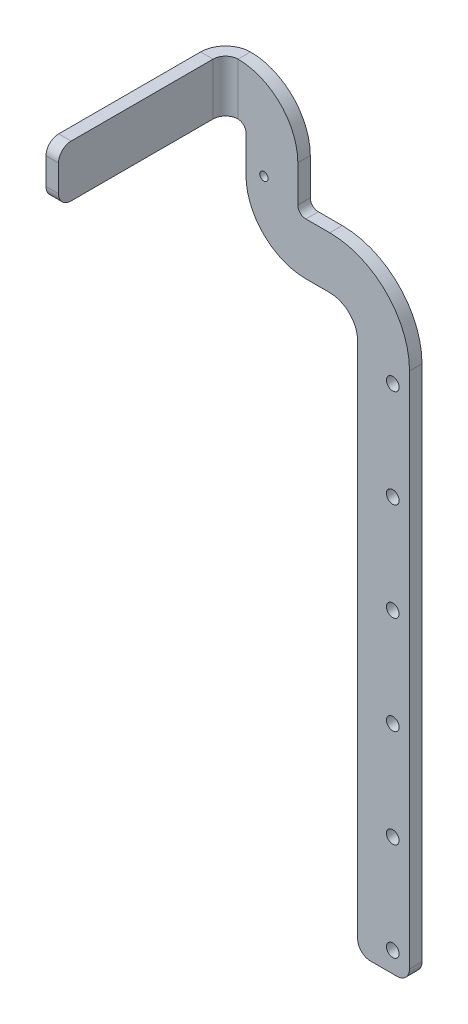
ISO-10303-21;
HEADER;
FILE_DESCRIPTION(('STEP AP214'),'2;1');
FILE_NAME('part.step','',(''),(''),'','','');
FILE_SCHEMA(('AUTOMOTIVE_DESIGN { 1 0 10303 214 1 1 1 1 }'));
ENDSEC;
DATA;
#1=APPLICATION_CONTEXT('core data for automotive mechanical design processes');
#2=APPLICATION_PROTOCOL_DEFINITION('international standard','automotive_design',2000,#1);
#3=PRODUCT_CONTEXT('',#1,'mechanical');
#4=PRODUCT('Part','Part','',(#3));
#5=PRODUCT_RELATED_PRODUCT_CATEGORY('part','',(#4));
#6=PRODUCT_DEFINITION_FORMATION('','',#4);
#7=PRODUCT_DEFINITION_CONTEXT('part definition',#1,'design');
#8=PRODUCT_DEFINITION('design','',#6,#7);
#9=PRODUCT_DEFINITION_SHAPE('','',#8);
#10=(LENGTH_UNIT() NAMED_UNIT(*) SI_UNIT(.MILLI.,.METRE.));
#11=(NAMED_UNIT(*) PLANE_ANGLE_UNIT() SI_UNIT($,.RADIAN.));
#12=(NAMED_UNIT(*) SI_UNIT($,.STERADIAN.) SOLID_ANGLE_UNIT());
#13=UNCERTAINTY_MEASURE_WITH_UNIT(LENGTH_MEASURE(1.E-05),#10,'distance_accuracy_value','');
#14=(GEOMETRIC_REPRESENTATION_CONTEXT(3) GLOBAL_UNCERTAINTY_ASSIGNED_CONTEXT((#13)) GLOBAL_UNIT_ASSIGNED_CONTEXT((#10,
#11,#12)) REPRESENTATION_CONTEXT('',''));
#15=CARTESIAN_POINT('',(0.,0.,0.));
#16=DIRECTION('',(0.,0.,1.));
#17=DIRECTION('',(1.,0.,0.));
#18=AXIS2_PLACEMENT_3D('',#15,#16,#17);
#19=CARTESIAN_POINT('',(123482.998157255,24999.885796135,0.));
#20=DIRECTION('',(0.,-1.,0.));
#21=DIRECTION('',(1.,0.,0.));
#22=AXIS2_PLACEMENT_3D('',#19,#20,#21);
#23=PLANE('',#22);
#24=DIRECTION('',(1.,0.,0.));
#25=VECTOR('',#24,1.);
#26=CARTESIAN_POINT('',(123475.998157255,24999.885796135,3.125));
#27=LINE('',#26,#25);
#28=CARTESIAN_POINT('',(123486.173157255,24999.885796135,3.125));
#29=VERTEX_POINT('',#28);
#30=CARTESIAN_POINT('',(123492.823157255,24999.885796135,3.125));
#31=VERTEX_POINT('',#30);
#32=EDGE_CURVE('E353',#29,#31,#27,.T.);
#33=ORIENTED_EDGE('',*,*,#32,.F.);
#34=DIRECTION('',(0.,0.,1.));
#35=VECTOR('',#34,1.);
#36=CARTESIAN_POINT('',(123486.173157255,24999.885796135,0.));
#37=LINE('',#36,#35);
#38=CARTESIAN_POINT('',(123486.173157255,24999.885796135,0.));
#39=VERTEX_POINT('',#38);
#40=EDGE_CURVE('E405',#29,#39,#37,.F.);
#41=ORIENTED_EDGE('',*,*,#40,.T.);
#42=DIRECTION('',(1.,0.,0.));
#43=VECTOR('',#42,1.);
#44=CARTESIAN_POINT('',(123482.998157255,24999.885796135,0.));
#45=LINE('',#44,#43);
#46=CARTESIAN_POINT('',(123492.823157255,24999.885796135,0.));
#47=VERTEX_POINT('',#46);
#48=EDGE_CURVE('E282',#39,#47,#45,.T.);
#49=ORIENTED_EDGE('',*,*,#48,.T.);
#50=DIRECTION('',(0.,0.,-1.));
#51=VECTOR('',#50,1.);
#52=CARTESIAN_POINT('',(123492.823157255,24999.885796135,0.));
#53=LINE('',#52,#51);
#54=EDGE_CURVE('E384',#31,#47,#53,.T.);
#55=ORIENTED_EDGE('',*,*,#54,.F.);
#56=EDGE_LOOP('',(#33,#41,#49,#55));
#57=FACE_BOUND('',#56,.T.);
#58=ADVANCED_FACE('F66',(#57),#23,.T.);
#59=CARTESIAN_POINT('',(123482.998157255,24999.885796135,0.));
#60=DIRECTION('',(1.,0.,0.));
#61=DIRECTION('',(0.,1.,0.));
#62=AXIS2_PLACEMENT_3D('',#59,#60,#61);
#63=PLANE('',#62);
#64=DIRECTION('',(0.,1.,0.));
#65=VECTOR('',#64,1.);
#66=CARTESIAN_POINT('',(123482.998157255,24999.885796135,0.));
#67=LINE('',#66,#65);
#68=CARTESIAN_POINT('',(123482.998157255,25003.060796135,0.));
#69=VERTEX_POINT('',#68);
#70=CARTESIAN_POINT('',(123482.998157255,25132.885796135,0.));
#71=VERTEX_POINT('',#70);
#72=EDGE_CURVE('E284',#69,#71,#67,.T.);
#73=ORIENTED_EDGE('',*,*,#72,.F.);
#74=DIRECTION('',(0.,0.,-1.));
#75=VECTOR('',#74,1.);
#76=CARTESIAN_POINT('',(123482.998157255,25003.060796135,0.));
#77=LINE('',#76,#75);
#78=CARTESIAN_POINT('',(123482.998157255,25003.060796135,3.125));
#79=VERTEX_POINT('',#78);
#80=EDGE_CURVE('E75',#69,#79,#77,.F.);
#81=ORIENTED_EDGE('',*,*,#80,.T.);
#82=DIRECTION('',(0.,1.,0.));
#83=VECTOR('',#82,1.);
#84=CARTESIAN_POINT('',(123482.998157255,25132.885796135,3.125));
#85=LINE('',#84,#83);
#86=CARTESIAN_POINT('',(123482.998157255,25132.885796135,3.125));
#87=VERTEX_POINT('',#86);
#88=EDGE_CURVE('E351',#79,#87,#85,.T.);
#89=ORIENTED_EDGE('',*,*,#88,.T.);
#90=DIRECTION('',(0.,0.,-1.));
#91=VECTOR('',#90,1.);
#92=CARTESIAN_POINT('',(123482.998157255,25132.885796135,0.));
#93=LINE('',#92,#91);
#94=EDGE_CURVE('E381',#87,#71,#93,.T.);
#95=ORIENTED_EDGE('',*,*,#94,.T.);
#96=EDGE_LOOP('',(#73,#81,#89,#95));
#97=FACE_BOUND('',#96,.T.);
#98=ADVANCED_FACE('F480',(#97),#63,.F.);
#99=CARTESIAN_POINT('',(123475.998157249,25132.885796135,0.));
#100=DIRECTION('',(0.,0.,1.));
#101=DIRECTION('',(1.,0.,0.));
#102=AXIS2_PLACEMENT_3D('',#99,#100,#101);
#103=CYLINDRICAL_SURFACE('',#102,7.00000000554723);
#104=ORIENTED_EDGE('',*,*,#94,.F.);
#105=CARTESIAN_POINT('',(123475.998157249,25132.885796135,3.125));
#106=DIRECTION('',(0.,0.,1.));
#107=DIRECTION('',(1.,0.,0.));
#108=AXIS2_PLACEMENT_3D('',#105,#106,#107);
#109=CIRCLE('',#108,7.00000000554723);
#110=CARTESIAN_POINT('',(123475.998158089,25139.8857961352,3.125));
#111=VERTEX_POINT('',#110);
#112=EDGE_CURVE('E348',#87,#111,#109,.T.);
#113=ORIENTED_EDGE('',*,*,#112,.T.);
#114=DIRECTION('',(0.,0.,-1.));
#115=VECTOR('',#114,1.);
#116=CARTESIAN_POINT('',(123475.998158089,25139.8857961352,0.));
#117=LINE('',#116,#115);
#118=CARTESIAN_POINT('',(123475.998158089,25139.8857961352,0.));
#119=VERTEX_POINT('',#118);
#120=EDGE_CURVE('E379',#111,#119,#117,.T.);
#121=ORIENTED_EDGE('',*,*,#120,.T.);
#122=CARTESIAN_POINT('',(123475.998157249,25132.885796135,0.));
#123=DIRECTION('',(0.,0.,1.));
#124=DIRECTION('',(1.,0.,0.));
#125=AXIS2_PLACEMENT_3D('',#122,#123,#124);
#126=CIRCLE('',#125,7.00000000554723);
#127=EDGE_CURVE('E286',#71,#119,#126,.T.);
#128=ORIENTED_EDGE('',*,*,#127,.F.);
#129=EDGE_LOOP('',(#104,#113,#121,#128));
#130=FACE_BOUND('',#129,.T.);
#131=ADVANCED_FACE('F485',(#130),#103,.F.);
#132=CARTESIAN_POINT('',(123469.998184079,25139.8857968504,0.));
#133=DIRECTION('',(-1.19194060241819E-07,-0.999999999999993,0.));
#134=DIRECTION('',(0.999999999999993,-1.19194060241819E-07,0.));
#135=AXIS2_PLACEMENT_3D('',#132,#133,#134);
#136=PLANE('',#135);
#137=ORIENTED_EDGE('',*,*,#120,.F.);
#138=DIRECTION('',(0.999999999999993,-1.19194060241819E-07,0.));
#139=VECTOR('',#138,1.);
#140=CARTESIAN_POINT('',(123469.998184079,25139.8857968504,3.125));
#141=LINE('',#140,#139);
#142=CARTESIAN_POINT('',(123469.998184079,25139.8857968503,3.125));
#143=VERTEX_POINT('',#142);
#144=EDGE_CURVE('E345',#143,#111,#141,.T.);
#145=ORIENTED_EDGE('',*,*,#144,.F.);
#146=DIRECTION('',(0.,0.,-1.));
#147=VECTOR('',#146,1.);
#148=CARTESIAN_POINT('',(123469.998184079,25139.8857968503,0.));
#149=LINE('',#148,#147);
#150=CARTESIAN_POINT('',(123469.998184079,25139.8857968503,0.));
#151=VERTEX_POINT('',#150);
#152=EDGE_CURVE('E377',#143,#151,#149,.T.);
#153=ORIENTED_EDGE('',*,*,#152,.T.);
#154=DIRECTION('',(0.999999999999993,-1.19194060241819E-07,0.));
#155=VECTOR('',#154,1.);
#156=CARTESIAN_POINT('',(123469.998184079,25139.8857968504,0.));
#157=LINE('',#156,#155);
#158=EDGE_CURVE('E289',#151,#119,#157,.T.);
#159=ORIENTED_EDGE('',*,*,#158,.T.);
#160=EDGE_LOOP('',(#137,#145,#153,#159));
#161=FACE_BOUND('',#160,.T.);
#162=ADVANCED_FACE('F510',(#161),#136,.T.);
#163=CARTESIAN_POINT('',(123469.998185867,25154.8857968489,0.));
#164=DIRECTION('',(0.,0.,1.));
#165=DIRECTION('',(1.,0.,0.));
#166=AXIS2_PLACEMENT_3D('',#163,#164,#165);
#167=CYLINDRICAL_SURFACE('',#166,14.9999999986276);
#168=ORIENTED_EDGE('',*,*,#152,.F.);
#169=CARTESIAN_POINT('',(123469.998185867,25154.8857968489,3.125));
#170=DIRECTION('',(0.,0.,1.));
#171=DIRECTION('',(1.,0.,0.));
#172=AXIS2_PLACEMENT_3D('',#169,#170,#171);
#173=CIRCLE('',#172,14.9999999986276);
#174=CARTESIAN_POINT('',(123454.998185868,25154.8857986359,3.125));
#175=VERTEX_POINT('',#174);
#176=EDGE_CURVE('E342',#175,#143,#173,.T.);
#177=ORIENTED_EDGE('',*,*,#176,.F.);
#178=DIRECTION('',(0.,0.,-1.));
#179=VECTOR('',#178,1.);
#180=CARTESIAN_POINT('',(123454.998185868,25154.8857986359,0.));
#181=LINE('',#180,#179);
#182=CARTESIAN_POINT('',(123454.998185868,25154.8857986359,0.));
#183=VERTEX_POINT('',#182);
#184=EDGE_CURVE('E375',#175,#183,#181,.T.);
#185=ORIENTED_EDGE('',*,*,#184,.T.);
#186=CARTESIAN_POINT('',(123469.998185867,25154.8857968489,0.));
#187=DIRECTION('',(0.,0.,1.));
#188=DIRECTION('',(1.,0.,0.));
#189=AXIS2_PLACEMENT_3D('',#186,#187,#188);
#190=CIRCLE('',#189,14.9999999986276);
#191=EDGE_CURVE('E292',#183,#151,#190,.T.);
#192=ORIENTED_EDGE('',*,*,#191,.T.);
#193=EDGE_LOOP('',(#168,#177,#185,#192));
#194=FACE_BOUND('',#193,.T.);
#195=ADVANCED_FACE('F514',(#194),#167,.T.);
#196=CARTESIAN_POINT('',(123454.998186963,25164.0775368475,0.));
#197=DIRECTION('',(-0.999999999999993,1.19068771400868E-07,0.));
#198=DIRECTION('',(-1.19068771400868E-07,-0.999999999999993,0.));
#199=AXIS2_PLACEMENT_3D('',#196,#197,#198);
#200=PLANE('',#199);
#201=ORIENTED_EDGE('',*,*,#184,.F.);
#202=DIRECTION('',(-1.19068771400868E-07,-0.999999999999993,0.));
#203=VECTOR('',#202,1.);
#204=CARTESIAN_POINT('',(123454.998186963,25164.0775368475,3.125));
#205=LINE('',#204,#203);
#206=CARTESIAN_POINT('',(123454.998186963,25164.0775368475,3.125));
#207=VERTEX_POINT('',#206);
#208=EDGE_CURVE('E339',#207,#175,#205,.T.);
#209=ORIENTED_EDGE('',*,*,#208,.F.);
#210=DIRECTION('',(0.,0.,-1.));
#211=VECTOR('',#210,1.);
#212=CARTESIAN_POINT('',(123454.998186963,25164.0775368475,0.));
#213=LINE('',#212,#211);
#214=CARTESIAN_POINT('',(123454.998186963,25164.0775368475,0.));
#215=VERTEX_POINT('',#214);
#216=EDGE_CURVE('E373',#207,#215,#213,.T.);
#217=ORIENTED_EDGE('',*,*,#216,.T.);
#218=DIRECTION('',(-1.19068771400868E-07,-0.999999999999993,0.));
#219=VECTOR('',#218,1.);
#220=CARTESIAN_POINT('',(123454.998186963,25164.0775368475,0.));
#221=LINE('',#220,#219);
#222=EDGE_CURVE('E295',#215,#183,#221,.T.);
#223=ORIENTED_EDGE('',*,*,#222,.T.);
#224=EDGE_LOOP('',(#201,#209,#217,#223));
#225=FACE_BOUND('',#224,.T.);
#226=ADVANCED_FACE('F518',(#225),#200,.T.);
#227=CARTESIAN_POINT('',(123452.998186964,25164.0775370857,0.));
#228=DIRECTION('',(0.,0.,1.));
#229=DIRECTION('',(1.,0.,0.));
#230=AXIS2_PLACEMENT_3D('',#227,#228,#229);
#231=CYLINDRICAL_SURFACE('',#230,1.99999999951592);
#232=ORIENTED_EDGE('',*,*,#216,.F.);
#233=CARTESIAN_POINT('',(123452.998186964,25164.0775370857,3.125));
#234=DIRECTION('',(0.,0.,1.));
#235=DIRECTION('',(1.,0.,0.));
#236=AXIS2_PLACEMENT_3D('',#233,#234,#235);
#237=CIRCLE('',#236,1.99999999951592);
#238=CARTESIAN_POINT('',(123452.998157255,25166.077537085,3.125));
#239=VERTEX_POINT('',#238);
#240=EDGE_CURVE('E336',#207,#239,#237,.T.);
#241=ORIENTED_EDGE('',*,*,#240,.T.);
#242=DIRECTION('',(0.,0.,-1.));
#243=VECTOR('',#242,1.);
#244=CARTESIAN_POINT('',(123452.998157255,25166.0775370852,0.));
#245=LINE('',#244,#243);
#246=CARTESIAN_POINT('',(123452.998157255,25166.077537085,-2.842344415388E-12));
#247=VERTEX_POINT('',#246);
#248=EDGE_CURVE('E370',#239,#247,#245,.T.);
#249=ORIENTED_EDGE('',*,*,#248,.T.);
#250=CARTESIAN_POINT('',(123452.998186964,25164.0775370857,0.));
#251=DIRECTION('',(0.,0.,1.));
#252=DIRECTION('',(1.,0.,0.));
#253=AXIS2_PLACEMENT_3D('',#250,#251,#252);
#254=CIRCLE('',#253,1.99999999951592);
#255=EDGE_CURVE('E298',#215,#247,#254,.T.);
#256=ORIENTED_EDGE('',*,*,#255,.F.);
#257=EDGE_LOOP('',(#232,#241,#249,#256));
#258=FACE_BOUND('',#257,.T.);
#259=ADVANCED_FACE('F522',(#258),#231,.F.);
#260=CARTESIAN_POINT('',(123452.998186964,25164.0775370857,0.));
#261=DIRECTION('',(0.,0.,1.));
#262=DIRECTION('',(1.,0.,0.));
#263=AXIS2_PLACEMENT_3D('',#260,#261,#262);
#264=CYLINDRICAL_SURFACE('',#263,14.9999999996743);
#265=DIRECTION('',(0.,0.,-1.));
#266=VECTOR('',#265,1.);
#267=CARTESIAN_POINT('',(123452.998157255,25179.0775370854,0.));
#268=LINE('',#267,#266);
#269=CARTESIAN_POINT('',(123452.998157255,25179.0775370854,3.125));
#270=VERTEX_POINT('',#269);
#271=CARTESIAN_POINT('',(123452.998157255,25179.0775370854,0.));
#272=VERTEX_POINT('',#271);
#273=EDGE_CURVE('E367',#270,#272,#268,.T.);
#274=ORIENTED_EDGE('',*,*,#273,.F.);
#275=CARTESIAN_POINT('',(123452.998186964,25164.0775370857,3.125));
#276=DIRECTION('',(0.,0.,1.));
#277=DIRECTION('',(1.,0.,0.));
#278=AXIS2_PLACEMENT_3D('',#275,#276,#277);
#279=CIRCLE('',#278,14.9999999996743);
#280=CARTESIAN_POINT('',(123467.998186963,25164.0775352988,3.125));
#281=VERTEX_POINT('',#280);
#282=EDGE_CURVE('E331',#281,#270,#279,.T.);
#283=ORIENTED_EDGE('',*,*,#282,.F.);
#284=DIRECTION('',(0.,0.,-1.));
#285=VECTOR('',#284,1.);
#286=CARTESIAN_POINT('',(123467.998186963,25164.0775352988,0.));
#287=LINE('',#286,#285);
#288=CARTESIAN_POINT('',(123467.998186963,25164.0775352988,0.));
#289=VERTEX_POINT('',#288);
#290=EDGE_CURVE('E365',#281,#289,#287,.T.);
#291=ORIENTED_EDGE('',*,*,#290,.T.);
#292=CARTESIAN_POINT('',(123452.998186964,25164.0775370857,0.));
#293=DIRECTION('',(0.,0.,1.));
#294=DIRECTION('',(1.,0.,0.));
#295=AXIS2_PLACEMENT_3D('',#292,#293,#294);
#296=CIRCLE('',#295,14.9999999996743);
#297=EDGE_CURVE('E301',#289,#272,#296,.T.);
#298=ORIENTED_EDGE('',*,*,#297,.T.);
#299=EDGE_LOOP('',(#274,#283,#291,#298));
#300=FACE_BOUND('',#299,.T.);
#301=ADVANCED_FACE('F443',(#300),#264,.T.);
#302=CARTESIAN_POINT('',(123467.998185868,25154.8857970872,0.));
#303=DIRECTION('',(0.999999999999993,-1.19161534191073E-07,0.));
#304=DIRECTION('',(1.19161534191073E-07,0.999999999999993,0.));
#305=AXIS2_PLACEMENT_3D('',#302,#303,#304);
#306=PLANE('',#305);
#307=ORIENTED_EDGE('',*,*,#290,.F.);
#308=DIRECTION('',(1.19161534191073E-07,0.999999999999993,0.));
#309=VECTOR('',#308,1.);
#310=CARTESIAN_POINT('',(123467.998185868,25154.8857970872,3.125));
#311=LINE('',#310,#309);
#312=CARTESIAN_POINT('',(123467.998185868,25154.8857970872,3.125));
#313=VERTEX_POINT('',#312);
#314=EDGE_CURVE('E328',#313,#281,#311,.T.);
#315=ORIENTED_EDGE('',*,*,#314,.F.);
#316=DIRECTION('',(0.,0.,-1.));
#317=VECTOR('',#316,1.);
#318=CARTESIAN_POINT('',(123467.998185868,25154.8857970872,0.));
#319=LINE('',#318,#317);
#320=CARTESIAN_POINT('',(123467.998185868,25154.8857970872,0.));
#321=VERTEX_POINT('',#320);
#322=EDGE_CURVE('E363',#313,#321,#319,.T.);
#323=ORIENTED_EDGE('',*,*,#322,.T.);
#324=DIRECTION('',(1.19161534191073E-07,0.999999999999993,0.));
#325=VECTOR('',#324,1.);
#326=CARTESIAN_POINT('',(123467.998185868,25154.8857970872,0.));
#327=LINE('',#326,#325);
#328=EDGE_CURVE('E304',#321,#289,#327,.T.);
#329=ORIENTED_EDGE('',*,*,#328,.T.);
#330=EDGE_LOOP('',(#307,#315,#323,#329));
#331=FACE_BOUND('',#330,.T.);
#332=ADVANCED_FACE('F439',(#331),#306,.T.);
#333=CARTESIAN_POINT('',(123469.998185867,25154.8857968489,0.));
#334=DIRECTION('',(0.,0.,1.));
#335=DIRECTION('',(1.,0.,0.));
#336=AXIS2_PLACEMENT_3D('',#333,#334,#335);
#337=CYLINDRICAL_SURFACE('',#336,1.99999999919777);
#338=ORIENTED_EDGE('',*,*,#322,.F.);
#339=CARTESIAN_POINT('',(123469.998185867,25154.8857968489,3.125));
#340=DIRECTION('',(0.,0.,1.));
#341=DIRECTION('',(1.,0.,0.));
#342=AXIS2_PLACEMENT_3D('',#339,#340,#341);
#343=CIRCLE('',#342,1.99999999919777);
#344=CARTESIAN_POINT('',(123469.998185629,25152.8857968499,3.125));
#345=VERTEX_POINT('',#344);
#346=EDGE_CURVE('E325',#313,#345,#343,.T.);
#347=ORIENTED_EDGE('',*,*,#346,.T.);
#348=DIRECTION('',(0.,0.,-1.));
#349=VECTOR('',#348,1.);
#350=CARTESIAN_POINT('',(123469.998185629,25152.8857968499,0.));
#351=LINE('',#350,#349);
#352=CARTESIAN_POINT('',(123469.998185629,25152.8857968499,0.));
#353=VERTEX_POINT('',#352);
#354=EDGE_CURVE('E361',#345,#353,#351,.T.);
#355=ORIENTED_EDGE('',*,*,#354,.T.);
#356=CARTESIAN_POINT('',(123469.998185867,25154.8857968489,0.));
#357=DIRECTION('',(0.,0.,1.));
#358=DIRECTION('',(1.,0.,0.));
#359=AXIS2_PLACEMENT_3D('',#356,#357,#358);
#360=CIRCLE('',#359,1.99999999919777);
#361=EDGE_CURVE('E307',#321,#353,#360,.T.);
#362=ORIENTED_EDGE('',*,*,#361,.F.);
#363=EDGE_LOOP('',(#338,#347,#355,#362));
#364=FACE_BOUND('',#363,.T.);
#365=ADVANCED_FACE('F435',(#364),#337,.F.);
#366=CARTESIAN_POINT('',(123475.998159637,25152.8857961356,0.));
#367=DIRECTION('',(1.19048398376522E-07,0.999999999999993,0.));
#368=DIRECTION('',(-0.999999999999993,1.19048398376522E-07,0.));
#369=AXIS2_PLACEMENT_3D('',#366,#367,#368);
#370=PLANE('',#369);
#371=ORIENTED_EDGE('',*,*,#354,.F.);
#372=DIRECTION('',(-0.999999999999993,1.19048398376522E-07,0.));
#373=VECTOR('',#372,1.);
#374=CARTESIAN_POINT('',(123475.998159637,25152.8857961356,3.125));
#375=LINE('',#374,#373);
#376=CARTESIAN_POINT('',(123475.998159637,25152.8857961355,3.125));
#377=VERTEX_POINT('',#376);
#378=EDGE_CURVE('E322',#377,#345,#375,.T.);
#379=ORIENTED_EDGE('',*,*,#378,.F.);
#380=DIRECTION('',(0.,0.,-1.));
#381=VECTOR('',#380,1.);
#382=CARTESIAN_POINT('',(123475.998159637,25152.8857961355,0.));
#383=LINE('',#382,#381);
#384=CARTESIAN_POINT('',(123475.998159637,25152.8857961355,0.));
#385=VERTEX_POINT('',#384);
#386=EDGE_CURVE('E359',#377,#385,#383,.T.);
#387=ORIENTED_EDGE('',*,*,#386,.T.);
#388=DIRECTION('',(-0.999999999999993,1.19048398376522E-07,0.));
#389=VECTOR('',#388,1.);
#390=CARTESIAN_POINT('',(123475.998159637,25152.8857961356,0.));
#391=LINE('',#390,#389);
#392=EDGE_CURVE('E310',#385,#353,#391,.T.);
#393=ORIENTED_EDGE('',*,*,#392,.T.);
#394=EDGE_LOOP('',(#371,#379,#387,#393));
#395=FACE_BOUND('',#394,.T.);
#396=ADVANCED_FACE('F573',(#395),#370,.T.);
#397=CARTESIAN_POINT('',(123475.998157255,25132.885796135,0.));
#398=DIRECTION('',(0.,0.,1.));
#399=DIRECTION('',(1.,0.,0.));
#400=AXIS2_PLACEMENT_3D('',#397,#398,#399);
#401=CYLINDRICAL_SURFACE('',#400,20.0000000005006);
#402=ORIENTED_EDGE('',*,*,#386,.F.);
#403=CARTESIAN_POINT('',(123475.998157255,25132.885796135,3.125));
#404=DIRECTION('',(0.,0.,1.));
#405=DIRECTION('',(1.,0.,0.));
#406=AXIS2_PLACEMENT_3D('',#403,#404,#405);
#407=CIRCLE('',#406,20.0000000005006);
#408=CARTESIAN_POINT('',(123495.998157255,25132.885796135,3.125));
#409=VERTEX_POINT('',#408);
#410=EDGE_CURVE('E279',#409,#377,#407,.T.);
#411=ORIENTED_EDGE('',*,*,#410,.F.);
#412=DIRECTION('',(0.,0.,-1.));
#413=VECTOR('',#412,1.);
#414=CARTESIAN_POINT('',(123495.998157255,25132.885796135,0.));
#415=LINE('',#414,#413);
#416=CARTESIAN_POINT('',(123495.998157255,25132.885796135,0.));
#417=VERTEX_POINT('',#416);
#418=EDGE_CURVE('E357',#409,#417,#415,.T.);
#419=ORIENTED_EDGE('',*,*,#418,.T.);
#420=CARTESIAN_POINT('',(123475.998157255,25132.885796135,0.));
#421=DIRECTION('',(0.,0.,1.));
#422=DIRECTION('',(1.,0.,0.));
#423=AXIS2_PLACEMENT_3D('',#420,#421,#422);
#424=CIRCLE('',#423,20.0000000005006);
#425=EDGE_CURVE('E313',#417,#385,#424,.T.);
#426=ORIENTED_EDGE('',*,*,#425,.T.);
#427=EDGE_LOOP('',(#402,#411,#419,#426));
#428=FACE_BOUND('',#427,.T.);
#429=ADVANCED_FACE('F429',(#428),#401,.T.);
#430=CARTESIAN_POINT('',(123495.998157255,25003.060796135,0.));
#431=DIRECTION('',(1.,-9.85154572977606E-13,0.));
#432=DIRECTION('',(9.85154572977606E-13,1.,0.));
#433=AXIS2_PLACEMENT_3D('',#430,#431,#432);
#434=PLANE('',#433);
#435=ORIENTED_EDGE('',*,*,#418,.F.);
#436=DIRECTION('',(0.,1.,0.));
#437=VECTOR('',#436,1.);
#438=CARTESIAN_POINT('',(123495.998157255,25132.885796135,3.125));
#439=LINE('',#438,#437);
#440=CARTESIAN_POINT('',(123495.998157255,25003.060796135,3.125));
#441=VERTEX_POINT('',#440);
#442=EDGE_CURVE('E270',#441,#409,#439,.T.);
#443=ORIENTED_EDGE('',*,*,#442,.F.);
#444=DIRECTION('',(0.,0.,-1.));
#445=VECTOR('',#444,1.);
#446=CARTESIAN_POINT('',(123495.998157255,25003.060796135,0.));
#447=LINE('',#446,#445);
#448=CARTESIAN_POINT('',(123495.998157255,25003.060796135,0.));
#449=VERTEX_POINT('',#448);
#450=EDGE_CURVE('E316',#441,#449,#447,.T.);
#451=ORIENTED_EDGE('',*,*,#450,.T.);
#452=DIRECTION('',(9.85154572977606E-13,1.,0.));
#453=VECTOR('',#452,1.);
#454=CARTESIAN_POINT('',(123495.998157255,25003.060796135,0.));
#455=LINE('',#454,#453);
#456=EDGE_CURVE('E275',#449,#417,#455,.T.);
#457=ORIENTED_EDGE('',*,*,#456,.T.);
#458=EDGE_LOOP('',(#435,#443,#451,#457));
#459=FACE_BOUND('',#458,.T.);
#460=ADVANCED_FACE('F427',(#459),#434,.T.);
#461=CARTESIAN_POINT('',(123492.823157255,25003.060796135,0.));
#462=DIRECTION('',(0.,0.,1.));
#463=DIRECTION('',(1.,0.,0.));
#464=AXIS2_PLACEMENT_3D('',#461,#462,#463);
#465=CYLINDRICAL_SURFACE('',#464,3.17499999999882);
#466=CARTESIAN_POINT('',(123492.823157255,25003.060796135,3.125));
#467=DIRECTION('',(0.,0.,1.));
#468=DIRECTION('',(1.,0.,0.));
#469=AXIS2_PLACEMENT_3D('',#466,#467,#468);
#470=CIRCLE('',#469,3.17499999999882);
#471=EDGE_CURVE('E319',#31,#441,#470,.T.);
#472=ORIENTED_EDGE('',*,*,#471,.F.);
#473=ORIENTED_EDGE('',*,*,#54,.T.);
#474=CARTESIAN_POINT('',(123492.823157255,25003.060796135,0.));
#475=DIRECTION('',(0.,0.,1.));
#476=DIRECTION('',(1.,0.,0.));
#477=AXIS2_PLACEMENT_3D('',#474,#475,#476);
#478=CIRCLE('',#477,3.17499999999882);
#479=EDGE_CURVE('E278',#47,#449,#478,.T.);
#480=ORIENTED_EDGE('',*,*,#479,.T.);
#481=ORIENTED_EDGE('',*,*,#450,.F.);
#482=EDGE_LOOP('',(#472,#473,#480,#481));
#483=FACE_BOUND('',#482,.T.);
#484=ADVANCED_FACE('F421',(#483),#465,.T.);
#485=CARTESIAN_POINT('',(123475.998157255,25132.885796135,0.));
#486=DIRECTION('',(0.,0.,1.));
#487=DIRECTION('',(1.,0.,0.));
#488=AXIS2_PLACEMENT_3D('',#485,#486,#487);
#489=PLANE('',#488);
#490=CARTESIAN_POINT('',(123459.498186107,25156.8857981,0.));
#491=DIRECTION('',(0.,0.,-1.));
#492=DIRECTION('',(-1.,0.,0.));
#493=AXIS2_PLACEMENT_3D('',#490,#491,#492);
#494=CIRCLE('',#493,1.05000000000509);
#495=CARTESIAN_POINT('',(123458.448186107,25156.8857981,0.));
#496=VERTEX_POINT('',#495);
#497=EDGE_CURVE('E968',#496,#496,#494,.T.);
#498=ORIENTED_EDGE('',*,*,#497,.F.);
#499=EDGE_LOOP('',(#498));
#500=FACE_BOUND('',#499,.T.);
#501=CARTESIAN_POINT('',(123491.798157255,25128.0275370856,0.));
#502=DIRECTION('',(0.,0.,1.));
#503=DIRECTION('',(1.,0.,0.));
#504=AXIS2_PLACEMENT_3D('',#501,#502,#503);
#505=CIRCLE('',#504,1.5874999999992);
#506=CARTESIAN_POINT('',(123493.385657255,25128.0275370856,0.));
#507=VERTEX_POINT('',#506);
#508=EDGE_CURVE('E974',#507,#507,#505,.T.);
#509=ORIENTED_EDGE('',*,*,#508,.T.);
#510=EDGE_LOOP('',(#509));
#511=FACE_BOUND('',#510,.T.);
#512=CARTESIAN_POINT('',(123491.798157255,25103.4275370856,0.));
#513=DIRECTION('',(0.,0.,1.));
#514=DIRECTION('',(1.,0.,0.));
#515=AXIS2_PLACEMENT_3D('',#512,#513,#514);
#516=CIRCLE('',#515,1.5874999999992);
#517=CARTESIAN_POINT('',(123493.385657255,25103.4275370856,0.));
#518=VERTEX_POINT('',#517);
#519=EDGE_CURVE('E980',#518,#518,#516,.T.);
#520=ORIENTED_EDGE('',*,*,#519,.T.);
#521=EDGE_LOOP('',(#520));
#522=FACE_BOUND('',#521,.T.);
#523=CARTESIAN_POINT('',(123491.798157255,25078.8275370856,0.));
#524=DIRECTION('',(0.,0.,1.));
#525=DIRECTION('',(1.,0.,0.));
#526=AXIS2_PLACEMENT_3D('',#523,#524,#525);
#527=CIRCLE('',#526,1.5874999999992);
#528=CARTESIAN_POINT('',(123493.385657255,25078.8275370856,0.));
#529=VERTEX_POINT('',#528);
#530=EDGE_CURVE('E986',#529,#529,#527,.T.);
#531=ORIENTED_EDGE('',*,*,#530,.T.);
#532=EDGE_LOOP('',(#531));
#533=FACE_BOUND('',#532,.T.);
#534=CARTESIAN_POINT('',(123491.798157255,25054.2275370856,0.));
#535=DIRECTION('',(0.,0.,1.));
#536=DIRECTION('',(1.,0.,0.));
#537=AXIS2_PLACEMENT_3D('',#534,#535,#536);
#538=CIRCLE('',#537,1.5874999999992);
#539=CARTESIAN_POINT('',(123493.385657255,25054.2275370856,0.));
#540=VERTEX_POINT('',#539);
#541=EDGE_CURVE('E992',#540,#540,#538,.T.);
#542=ORIENTED_EDGE('',*,*,#541,.T.);
#543=EDGE_LOOP('',(#542));
#544=FACE_BOUND('',#543,.T.);
#545=CARTESIAN_POINT('',(123491.798157255,25029.6275370856,0.));
#546=DIRECTION('',(0.,0.,1.));
#547=DIRECTION('',(1.,0.,0.));
#548=AXIS2_PLACEMENT_3D('',#545,#546,#547);
#549=CIRCLE('',#548,1.5874999999992);
#550=CARTESIAN_POINT('',(123493.385657255,25029.6275370856,0.));
#551=VERTEX_POINT('',#550);
#552=EDGE_CURVE('E998',#551,#551,#549,.T.);
#553=ORIENTED_EDGE('',*,*,#552,.T.);
#554=EDGE_LOOP('',(#553));
#555=FACE_BOUND('',#554,.T.);
#556=CARTESIAN_POINT('',(123491.798157255,25005.0275370856,0.));
#557=DIRECTION('',(0.,0.,1.));
#558=DIRECTION('',(1.,0.,0.));
#559=AXIS2_PLACEMENT_3D('',#556,#557,#558);
#560=CIRCLE('',#559,1.5874999999992);
#561=CARTESIAN_POINT('',(123493.385657255,25005.0275370856,0.));
#562=VERTEX_POINT('',#561);
#563=EDGE_CURVE('E269',#562,#562,#560,.T.);
#564=ORIENTED_EDGE('',*,*,#563,.T.);
#565=EDGE_LOOP('',(#564));
#566=FACE_BOUND('',#565,.T.);
#567=ORIENTED_EDGE('',*,*,#48,.F.);
#568=CARTESIAN_POINT('',(123486.173157255,25003.060796135,0.));
#569=DIRECTION('',(0.,0.,1.));
#570=DIRECTION('',(1.,0.,0.));
#571=AXIS2_PLACEMENT_3D('',#568,#569,#570);
#572=CIRCLE('',#571,3.175);
#573=EDGE_CURVE('E89',#39,#69,#572,.F.);
#574=ORIENTED_EDGE('',*,*,#573,.T.);
#575=ORIENTED_EDGE('',*,*,#72,.T.);
#576=ORIENTED_EDGE('',*,*,#127,.T.);
#577=ORIENTED_EDGE('',*,*,#158,.F.);
#578=ORIENTED_EDGE('',*,*,#191,.F.);
#579=ORIENTED_EDGE('',*,*,#222,.F.);
#580=ORIENTED_EDGE('',*,*,#255,.T.);
#581=DIRECTION('',(0.,-1.,0.));
#582=VECTOR('',#581,1.);
#583=CARTESIAN_POINT('',(123452.998157255,25179.0775370854,0.));
#584=LINE('',#583,#582);
#585=EDGE_CURVE('E222',#272,#247,#584,.T.);
#586=ORIENTED_EDGE('',*,*,#585,.F.);
#587=ORIENTED_EDGE('',*,*,#297,.F.);
#588=ORIENTED_EDGE('',*,*,#328,.F.);
#589=ORIENTED_EDGE('',*,*,#361,.T.);
#590=ORIENTED_EDGE('',*,*,#392,.F.);
#591=ORIENTED_EDGE('',*,*,#425,.F.);
#592=ORIENTED_EDGE('',*,*,#456,.F.);
#593=ORIENTED_EDGE('',*,*,#479,.F.);
#594=EDGE_LOOP('',(#567,#574,#575,#576,#577,#578,#579,#580,#586,#587,#588,#589,#590,#591,#592,#593));
#595=FACE_BOUND('',#594,.T.);
#596=ADVANCED_FACE('F416',(#500,#511,#522,#533,#544,#555,#566,#595),#489,.F.);
#597=CARTESIAN_POINT('',(123475.998157255,25132.885796135,3.125));
#598=DIRECTION('',(0.,0.,1.));
#599=DIRECTION('',(1.,0.,0.));
#600=AXIS2_PLACEMENT_3D('',#597,#598,#599);
#601=PLANE('',#600);
#602=CARTESIAN_POINT('',(123459.498186107,25156.8857981,3.125));
#603=DIRECTION('',(0.,0.,1.));
#604=DIRECTION('',(1.,0.,0.));
#605=AXIS2_PLACEMENT_3D('',#602,#603,#604);
#606=CIRCLE('',#605,1.05000000000509);
#607=CARTESIAN_POINT('',(123460.548186107,25156.8857981,3.125));
#608=VERTEX_POINT('',#607);
#609=EDGE_CURVE('E70',#608,#608,#606,.T.);
#610=ORIENTED_EDGE('',*,*,#609,.F.);
#611=EDGE_LOOP('',(#610));
#612=FACE_BOUND('',#611,.T.);
#613=CARTESIAN_POINT('',(123491.798157255,25128.0275370856,3.125));
#614=DIRECTION('',(0.,0.,1.));
#615=DIRECTION('',(1.,0.,0.));
#616=AXIS2_PLACEMENT_3D('',#613,#614,#615);
#617=CIRCLE('',#616,1.5874999999992);
#618=CARTESIAN_POINT('',(123493.385657255,25128.0275370856,3.125));
#619=VERTEX_POINT('',#618);
#620=EDGE_CURVE('E970',#619,#619,#617,.T.);
#621=ORIENTED_EDGE('',*,*,#620,.F.);
#622=EDGE_LOOP('',(#621));
#623=FACE_BOUND('',#622,.T.);
#624=CARTESIAN_POINT('',(123491.798157255,25103.4275370856,3.125));
#625=DIRECTION('',(0.,0.,1.));
#626=DIRECTION('',(1.,0.,0.));
#627=AXIS2_PLACEMENT_3D('',#624,#625,#626);
#628=CIRCLE('',#627,1.5874999999992);
#629=CARTESIAN_POINT('',(123493.385657255,25103.4275370856,3.125));
#630=VERTEX_POINT('',#629);
#631=EDGE_CURVE('E977',#630,#630,#628,.T.);
#632=ORIENTED_EDGE('',*,*,#631,.F.);
#633=EDGE_LOOP('',(#632));
#634=FACE_BOUND('',#633,.T.);
#635=CARTESIAN_POINT('',(123491.798157255,25078.8275370856,3.125));
#636=DIRECTION('',(0.,0.,1.));
#637=DIRECTION('',(1.,0.,0.));
#638=AXIS2_PLACEMENT_3D('',#635,#636,#637);
#639=CIRCLE('',#638,1.5874999999992);
#640=CARTESIAN_POINT('',(123493.385657255,25078.8275370856,3.125));
#641=VERTEX_POINT('',#640);
#642=EDGE_CURVE('E983',#641,#641,#639,.T.);
#643=ORIENTED_EDGE('',*,*,#642,.F.);
#644=EDGE_LOOP('',(#643));
#645=FACE_BOUND('',#644,.T.);
#646=CARTESIAN_POINT('',(123491.798157255,25054.2275370856,3.125));
#647=DIRECTION('',(0.,0.,1.));
#648=DIRECTION('',(1.,0.,0.));
#649=AXIS2_PLACEMENT_3D('',#646,#647,#648);
#650=CIRCLE('',#649,1.5874999999992);
#651=CARTESIAN_POINT('',(123493.385657255,25054.2275370856,3.125));
#652=VERTEX_POINT('',#651);
#653=EDGE_CURVE('E989',#652,#652,#650,.T.);
#654=ORIENTED_EDGE('',*,*,#653,.F.);
#655=EDGE_LOOP('',(#654));
#656=FACE_BOUND('',#655,.T.);
#657=CARTESIAN_POINT('',(123491.798157255,25029.6275370856,3.125));
#658=DIRECTION('',(0.,0.,1.));
#659=DIRECTION('',(1.,0.,0.));
#660=AXIS2_PLACEMENT_3D('',#657,#658,#659);
#661=CIRCLE('',#660,1.5874999999992);
#662=CARTESIAN_POINT('',(123493.385657255,25029.6275370856,3.125));
#663=VERTEX_POINT('',#662);
#664=EDGE_CURVE('E995',#663,#663,#661,.T.);
#665=ORIENTED_EDGE('',*,*,#664,.F.);
#666=EDGE_LOOP('',(#665));
#667=FACE_BOUND('',#666,.T.);
#668=CARTESIAN_POINT('',(123491.798157255,25005.0275370856,3.125));
#669=DIRECTION('',(0.,0.,1.));
#670=DIRECTION('',(1.,0.,0.));
#671=AXIS2_PLACEMENT_3D('',#668,#669,#670);
#672=CIRCLE('',#671,1.5874999999992);
#673=CARTESIAN_POINT('',(123493.385657255,25005.0275370856,3.125));
#674=VERTEX_POINT('',#673);
#675=EDGE_CURVE('E1001',#674,#674,#672,.T.);
#676=ORIENTED_EDGE('',*,*,#675,.F.);
#677=EDGE_LOOP('',(#676));
#678=FACE_BOUND('',#677,.T.);
#679=ORIENTED_EDGE('',*,*,#88,.F.);
#680=CARTESIAN_POINT('',(123486.173157255,25003.060796135,3.125));
#681=DIRECTION('',(0.,0.,1.));
#682=DIRECTION('',(1.,0.,0.));
#683=AXIS2_PLACEMENT_3D('',#680,#681,#682);
#684=CIRCLE('',#683,3.175);
#685=EDGE_CURVE('E13',#79,#29,#684,.T.);
#686=ORIENTED_EDGE('',*,*,#685,.T.);
#687=ORIENTED_EDGE('',*,*,#32,.T.);
#688=ORIENTED_EDGE('',*,*,#471,.T.);
#689=ORIENTED_EDGE('',*,*,#442,.T.);
#690=ORIENTED_EDGE('',*,*,#410,.T.);
#691=ORIENTED_EDGE('',*,*,#378,.T.);
#692=ORIENTED_EDGE('',*,*,#346,.F.);
#693=ORIENTED_EDGE('',*,*,#314,.T.);
#694=ORIENTED_EDGE('',*,*,#282,.T.);
#695=DIRECTION('',(0.,1.,0.));
#696=VECTOR('',#695,1.);
#697=CARTESIAN_POINT('',(123452.998157255,25132.885796135,3.125));
#698=LINE('',#697,#696);
#699=EDGE_CURVE('E334',#270,#239,#698,.F.);
#700=ORIENTED_EDGE('',*,*,#699,.T.);
#701=ORIENTED_EDGE('',*,*,#240,.F.);
#702=ORIENTED_EDGE('',*,*,#208,.T.);
#703=ORIENTED_EDGE('',*,*,#176,.T.);
#704=ORIENTED_EDGE('',*,*,#144,.T.);
#705=ORIENTED_EDGE('',*,*,#112,.F.);
#706=EDGE_LOOP('',(#679,#686,#687,#688,#689,#690,#691,#692,#693,#694,#700,#701,#702,#703,#704,#705));
#707=FACE_BOUND('',#706,.T.);
#708=ADVANCED_FACE('F424',(#612,#623,#634,#645,#656,#667,#678,#707),#601,.T.);
#709=CARTESIAN_POINT('',(123452.998157255,25179.0775370854,6.24999999999432));
#710=DIRECTION('',(0.,1.,0.));
#711=DIRECTION('',(0.,0.,1.));
#712=AXIS2_PLACEMENT_3D('',#709,#710,#711);
#713=PLANE('',#712);
#714=DIRECTION('',(1.,0.,0.));
#715=VECTOR('',#714,1.);
#716=CARTESIAN_POINT('',(123446.748157255,25179.0775370854,6.24999999999432));
#717=LINE('',#716,#715);
#718=CARTESIAN_POINT('',(123449.873157255,25179.0775370854,6.24999999999432));
#719=VERTEX_POINT('',#718);
#720=CARTESIAN_POINT('',(123446.748157255,25179.0775370854,6.24999999999432));
#721=VERTEX_POINT('',#720);
#722=EDGE_CURVE('E266',#719,#721,#717,.F.);
#723=ORIENTED_EDGE('',*,*,#722,.F.);
#724=CARTESIAN_POINT('',(123452.998157255,25179.0775370854,6.24999999999432));
#725=DIRECTION('',(0.,-1.,0.));
#726=DIRECTION('',(0.,0.,-1.));
#727=AXIS2_PLACEMENT_3D('',#724,#725,#726);
#728=CIRCLE('',#727,3.12499999999716);
#729=EDGE_CURVE('E226',#270,#719,#728,.F.);
#730=ORIENTED_EDGE('',*,*,#729,.F.);
#731=ORIENTED_EDGE('',*,*,#273,.T.);
#732=CARTESIAN_POINT('',(123452.998157255,25179.0775370854,6.24999999999432));
#733=DIRECTION('',(0.,-1.,0.));
#734=DIRECTION('',(0.,0.,-1.));
#735=AXIS2_PLACEMENT_3D('',#732,#733,#734);
#736=CIRCLE('',#735,6.24999999999716);
#737=EDGE_CURVE('E225',#272,#721,#736,.F.);
#738=ORIENTED_EDGE('',*,*,#737,.T.);
#739=EDGE_LOOP('',(#723,#730,#731,#738));
#740=FACE_BOUND('',#739,.T.);
#741=ADVANCED_FACE('F448',(#740),#713,.T.);
#742=CARTESIAN_POINT('',(123452.998157255,25166.077537085,6.24999999999432));
#743=DIRECTION('',(0.,1.,0.));
#744=DIRECTION('',(0.,0.,1.));
#745=AXIS2_PLACEMENT_3D('',#742,#743,#744);
#746=PLANE('',#745);
#747=CARTESIAN_POINT('',(123452.998157255,25166.077537085,6.24999999999432));
#748=DIRECTION('',(0.,-1.,0.));
#749=DIRECTION('',(0.,0.,-1.));
#750=AXIS2_PLACEMENT_3D('',#747,#748,#749);
#751=CIRCLE('',#750,3.12499999999716);
#752=CARTESIAN_POINT('',(123449.873157255,25166.077537085,6.24999999999432));
#753=VERTEX_POINT('',#752);
#754=EDGE_CURVE('E233',#753,#239,#751,.T.);
#755=ORIENTED_EDGE('',*,*,#754,.F.);
#756=DIRECTION('',(1.,0.,0.));
#757=VECTOR('',#756,1.);
#758=CARTESIAN_POINT('',(123449.873157255,25166.077537085,6.24999999999432));
#759=LINE('',#758,#757);
#760=CARTESIAN_POINT('',(123446.748157255,25166.077537085,6.24999999999432));
#761=VERTEX_POINT('',#760);
#762=EDGE_CURVE('E230',#753,#761,#759,.F.);
#763=ORIENTED_EDGE('',*,*,#762,.T.);
#764=CARTESIAN_POINT('',(123452.998157255,25166.077537085,6.24999999999432));
#765=DIRECTION('',(0.,-1.,0.));
#766=DIRECTION('',(0.,0.,-1.));
#767=AXIS2_PLACEMENT_3D('',#764,#765,#766);
#768=CIRCLE('',#767,6.24999999999716);
#769=EDGE_CURVE('E215',#761,#247,#768,.T.);
#770=ORIENTED_EDGE('',*,*,#769,.T.);
#771=ORIENTED_EDGE('',*,*,#248,.F.);
#772=EDGE_LOOP('',(#755,#763,#770,#771));
#773=FACE_BOUND('',#772,.T.);
#774=ADVANCED_FACE('F231',(#773),#746,.F.);
#775=CARTESIAN_POINT('',(123452.998157255,25166.077537085,6.24999999999432));
#776=DIRECTION('',(0.,-1.,0.));
#777=DIRECTION('',(-1.,0.,0.));
#778=AXIS2_PLACEMENT_3D('',#775,#776,#777);
#779=CYLINDRICAL_SURFACE('',#778,6.24999999999716);
#780=ORIENTED_EDGE('',*,*,#585,.T.);
#781=ORIENTED_EDGE('',*,*,#769,.F.);
#782=DIRECTION('',(0.,-1.,0.));
#783=VECTOR('',#782,1.);
#784=CARTESIAN_POINT('',(123446.748157255,25179.0775370854,6.24999999999432));
#785=LINE('',#784,#783);
#786=EDGE_CURVE('E220',#761,#721,#785,.F.);
#787=ORIENTED_EDGE('',*,*,#786,.T.);
#788=ORIENTED_EDGE('',*,*,#737,.F.);
#789=EDGE_LOOP('',(#780,#781,#787,#788));
#790=FACE_BOUND('',#789,.T.);
#791=ADVANCED_FACE('F217',(#790),#779,.T.);
#792=CARTESIAN_POINT('',(123452.998157255,25166.077537085,6.24999999999432));
#793=DIRECTION('',(0.,-1.,0.));
#794=DIRECTION('',(-1.,0.,0.));
#795=AXIS2_PLACEMENT_3D('',#792,#793,#794);
#796=CYLINDRICAL_SURFACE('',#795,3.12499999999716);
#797=ORIENTED_EDGE('',*,*,#699,.F.);
#798=ORIENTED_EDGE('',*,*,#729,.T.);
#799=DIRECTION('',(0.,-1.,0.));
#800=VECTOR('',#799,1.);
#801=CARTESIAN_POINT('',(123449.873157255,25179.0775370854,6.24999999999432));
#802=LINE('',#801,#800);
#803=EDGE_CURVE('E238',#719,#753,#802,.T.);
#804=ORIENTED_EDGE('',*,*,#803,.T.);
#805=ORIENTED_EDGE('',*,*,#754,.T.);
#806=EDGE_LOOP('',(#797,#798,#804,#805));
#807=FACE_BOUND('',#806,.T.);
#808=ADVANCED_FACE('F452',(#807),#796,.F.);
#809=CARTESIAN_POINT('',(123446.748157255,25179.0775370854,3.12499999999999));
#810=DIRECTION('',(0.,-1.,0.));
#811=DIRECTION('',(0.,0.,-1.));
#812=AXIS2_PLACEMENT_3D('',#809,#810,#811);
#813=PLANE('',#812);
#814=DIRECTION('',(0.,0.,-1.));
#815=VECTOR('',#814,1.);
#816=CARTESIAN_POINT('',(123446.748157255,25179.0775370854,0.));
#817=LINE('',#816,#815);
#818=CARTESIAN_POINT('',(123446.748157255,25179.0775370854,41.825));
#819=VERTEX_POINT('',#818);
#820=EDGE_CURVE('E246',#819,#721,#817,.T.);
#821=ORIENTED_EDGE('',*,*,#820,.F.);
#822=DIRECTION('',(1.,0.,0.));
#823=VECTOR('',#822,1.);
#824=CARTESIAN_POINT('',(123446.748157255,25179.0775370854,41.825));
#825=LINE('',#824,#823);
#826=CARTESIAN_POINT('',(123449.873157255,25179.0775370854,41.825));
#827=VERTEX_POINT('',#826);
#828=EDGE_CURVE('E402',#819,#827,#825,.T.);
#829=ORIENTED_EDGE('',*,*,#828,.T.);
#830=DIRECTION('',(0.,0.,1.));
#831=VECTOR('',#830,1.);
#832=CARTESIAN_POINT('',(123449.873157255,25179.0775370854,3.12499999999999));
#833=LINE('',#832,#831);
#834=EDGE_CURVE('E247',#827,#719,#833,.F.);
#835=ORIENTED_EDGE('',*,*,#834,.T.);
#836=ORIENTED_EDGE('',*,*,#722,.T.);
#837=EDGE_LOOP('',(#821,#829,#835,#836));
#838=FACE_BOUND('',#837,.T.);
#839=ADVANCED_FACE('F469',(#838),#813,.F.);
#840=CARTESIAN_POINT('',(123446.748157255,25166.077537085,45.));
#841=DIRECTION('',(0.,1.,0.));
#842=DIRECTION('',(0.,0.,1.));
#843=AXIS2_PLACEMENT_3D('',#840,#841,#842);
#844=PLANE('',#843);
#845=DIRECTION('',(0.,0.,-1.));
#846=VECTOR('',#845,1.);
#847=CARTESIAN_POINT('',(123449.873157255,25166.077537085,45.));
#848=LINE('',#847,#846);
#849=CARTESIAN_POINT('',(123449.873157255,25166.077537085,41.825));
#850=VERTEX_POINT('',#849);
#851=EDGE_CURVE('E262',#753,#850,#848,.F.);
#852=ORIENTED_EDGE('',*,*,#851,.T.);
#853=DIRECTION('',(1.,0.,0.));
#854=VECTOR('',#853,1.);
#855=CARTESIAN_POINT('',(123446.748157255,25166.077537085,41.825));
#856=LINE('',#855,#854);
#857=CARTESIAN_POINT('',(123446.748157255,25166.077537085,41.825));
#858=VERTEX_POINT('',#857);
#859=EDGE_CURVE('E251',#850,#858,#856,.F.);
#860=ORIENTED_EDGE('',*,*,#859,.T.);
#861=DIRECTION('',(0.,0.,1.));
#862=VECTOR('',#861,1.);
#863=CARTESIAN_POINT('',(123446.748157255,25166.077537085,0.));
#864=LINE('',#863,#862);
#865=EDGE_CURVE('E243',#761,#858,#864,.T.);
#866=ORIENTED_EDGE('',*,*,#865,.F.);
#867=ORIENTED_EDGE('',*,*,#762,.F.);
#868=EDGE_LOOP('',(#852,#860,#866,#867));
#869=FACE_BOUND('',#868,.T.);
#870=ADVANCED_FACE('F249',(#869),#844,.F.);
#871=CARTESIAN_POINT('',(123446.748157255,0.,0.));
#872=DIRECTION('',(1.,0.,0.));
#873=DIRECTION('',(0.,0.,-1.));
#874=AXIS2_PLACEMENT_3D('',#871,#872,#873);
#875=PLANE('',#874);
#876=ORIENTED_EDGE('',*,*,#865,.T.);
#877=CARTESIAN_POINT('',(123446.748157255,25169.252537085,41.825));
#878=DIRECTION('',(1.,0.,0.));
#879=DIRECTION('',(0.,0.,-1.));
#880=AXIS2_PLACEMENT_3D('',#877,#878,#879);
#881=CIRCLE('',#880,3.175);
#882=CARTESIAN_POINT('',(123446.748157255,25169.252537085,45.));
#883=VERTEX_POINT('',#882);
#884=EDGE_CURVE('E400',#858,#883,#881,.F.);
#885=ORIENTED_EDGE('',*,*,#884,.T.);
#886=DIRECTION('',(0.,1.,0.));
#887=VECTOR('',#886,1.);
#888=CARTESIAN_POINT('',(123446.748157255,0.,45.));
#889=LINE('',#888,#887);
#890=CARTESIAN_POINT('',(123446.748157255,25175.9025370854,45.));
#891=VERTEX_POINT('',#890);
#892=EDGE_CURVE('E252',#883,#891,#889,.T.);
#893=ORIENTED_EDGE('',*,*,#892,.T.);
#894=CARTESIAN_POINT('',(123446.748157255,25175.9025370854,41.825));
#895=DIRECTION('',(1.,0.,0.));
#896=DIRECTION('',(0.,0.,-1.));
#897=AXIS2_PLACEMENT_3D('',#894,#895,#896);
#898=CIRCLE('',#897,3.175);
#899=EDGE_CURVE('E398',#891,#819,#898,.F.);
#900=ORIENTED_EDGE('',*,*,#899,.T.);
#901=ORIENTED_EDGE('',*,*,#820,.T.);
#902=ORIENTED_EDGE('',*,*,#786,.F.);
#903=EDGE_LOOP('',(#876,#885,#893,#900,#901,#902));
#904=FACE_BOUND('',#903,.T.);
#905=ADVANCED_FACE('F242',(#904),#875,.F.);
#906=CARTESIAN_POINT('',(123449.873157255,0.,0.));
#907=DIRECTION('',(1.,0.,0.));
#908=DIRECTION('',(0.,0.,-1.));
#909=AXIS2_PLACEMENT_3D('',#906,#907,#908);
#910=PLANE('',#909);
#911=DIRECTION('',(0.,-1.,0.));
#912=VECTOR('',#911,1.);
#913=CARTESIAN_POINT('',(123449.873157255,25179.0775370854,45.));
#914=LINE('',#913,#912);
#915=CARTESIAN_POINT('',(123449.873157255,25169.252537085,45.));
#916=VERTEX_POINT('',#915);
#917=CARTESIAN_POINT('',(123449.873157255,25175.9025370854,45.));
#918=VERTEX_POINT('',#917);
#919=EDGE_CURVE('E256',#916,#918,#914,.F.);
#920=ORIENTED_EDGE('',*,*,#919,.F.);
#921=CARTESIAN_POINT('',(123449.873157255,25169.252537085,41.825));
#922=DIRECTION('',(1.,0.,0.));
#923=DIRECTION('',(0.,0.,-1.));
#924=AXIS2_PLACEMENT_3D('',#921,#922,#923);
#925=CIRCLE('',#924,3.175);
#926=EDGE_CURVE('E395',#916,#850,#925,.T.);
#927=ORIENTED_EDGE('',*,*,#926,.T.);
#928=ORIENTED_EDGE('',*,*,#851,.F.);
#929=ORIENTED_EDGE('',*,*,#803,.F.);
#930=ORIENTED_EDGE('',*,*,#834,.F.);
#931=CARTESIAN_POINT('',(123449.873157255,25175.9025370854,41.825));
#932=DIRECTION('',(1.,0.,0.));
#933=DIRECTION('',(0.,0.,-1.));
#934=AXIS2_PLACEMENT_3D('',#931,#932,#933);
#935=CIRCLE('',#934,3.175);
#936=EDGE_CURVE('E393',#827,#918,#935,.T.);
#937=ORIENTED_EDGE('',*,*,#936,.T.);
#938=EDGE_LOOP('',(#920,#927,#928,#929,#930,#937));
#939=FACE_BOUND('',#938,.T.);
#940=ADVANCED_FACE('F456',(#939),#910,.T.);
#941=CARTESIAN_POINT('',(123446.748157255,25179.0775370854,45.));
#942=DIRECTION('',(0.,0.,-1.));
#943=DIRECTION('',(-1.,0.,0.));
#944=AXIS2_PLACEMENT_3D('',#941,#942,#943);
#945=PLANE('',#944);
#946=ORIENTED_EDGE('',*,*,#892,.F.);
#947=DIRECTION('',(1.,0.,0.));
#948=VECTOR('',#947,1.);
#949=CARTESIAN_POINT('',(123446.748157255,25169.252537085,45.));
#950=LINE('',#949,#948);
#951=EDGE_CURVE('E390',#883,#916,#950,.T.);
#952=ORIENTED_EDGE('',*,*,#951,.T.);
#953=ORIENTED_EDGE('',*,*,#919,.T.);
#954=DIRECTION('',(1.,0.,0.));
#955=VECTOR('',#954,1.);
#956=CARTESIAN_POINT('',(123446.748157255,25175.9025370854,45.));
#957=LINE('',#956,#955);
#958=EDGE_CURVE('E387',#918,#891,#957,.F.);
#959=ORIENTED_EDGE('',*,*,#958,.T.);
#960=EDGE_LOOP('',(#946,#952,#953,#959));
#961=FACE_BOUND('',#960,.T.);
#962=ADVANCED_FACE('F463',(#961),#945,.F.);
#963=CARTESIAN_POINT('',(123446.748157255,25169.252537085,41.825));
#964=DIRECTION('',(1.,0.,0.));
#965=DIRECTION('',(0.,0.,-1.));
#966=AXIS2_PLACEMENT_3D('',#963,#964,#965);
#967=CYLINDRICAL_SURFACE('',#966,3.175);
#968=ORIENTED_EDGE('',*,*,#884,.F.);
#969=ORIENTED_EDGE('',*,*,#859,.F.);
#970=ORIENTED_EDGE('',*,*,#926,.F.);
#971=ORIENTED_EDGE('',*,*,#951,.F.);
#972=EDGE_LOOP('',(#968,#969,#970,#971));
#973=FACE_BOUND('',#972,.T.);
#974=ADVANCED_FACE('F458',(#973),#967,.T.);
#975=CARTESIAN_POINT('',(123446.748157255,25175.9025370854,41.825));
#976=DIRECTION('',(1.,0.,0.));
#977=DIRECTION('',(0.,0.,-1.));
#978=AXIS2_PLACEMENT_3D('',#975,#976,#977);
#979=CYLINDRICAL_SURFACE('',#978,3.175);
#980=ORIENTED_EDGE('',*,*,#899,.F.);
#981=ORIENTED_EDGE('',*,*,#958,.F.);
#982=ORIENTED_EDGE('',*,*,#936,.F.);
#983=ORIENTED_EDGE('',*,*,#828,.F.);
#984=EDGE_LOOP('',(#980,#981,#982,#983));
#985=FACE_BOUND('',#984,.T.);
#986=ADVANCED_FACE('F466',(#985),#979,.T.);
#987=CARTESIAN_POINT('',(123486.173157255,25003.060796135,0.));
#988=DIRECTION('',(0.,0.,1.));
#989=DIRECTION('',(1.,0.,0.));
#990=AXIS2_PLACEMENT_3D('',#987,#988,#989);
#991=CYLINDRICAL_SURFACE('',#990,3.175);
#992=ORIENTED_EDGE('',*,*,#685,.F.);
#993=ORIENTED_EDGE('',*,*,#80,.F.);
#994=ORIENTED_EDGE('',*,*,#573,.F.);
#995=ORIENTED_EDGE('',*,*,#40,.F.);
#996=EDGE_LOOP('',(#992,#993,#994,#995));
#997=FACE_BOUND('',#996,.T.);
#998=ADVANCED_FACE('F68',(#997),#991,.T.);
#999=CARTESIAN_POINT('',(123491.798157255,25005.0275370856,-6.875));
#1000=DIRECTION('',(0.,0.,1.));
#1001=DIRECTION('',(1.,0.,0.));
#1002=AXIS2_PLACEMENT_3D('',#999,#1000,#1001);
#1003=CYLINDRICAL_SURFACE('',#1002,1.5874999999992);
#1004=ORIENTED_EDGE('',*,*,#675,.T.);
#1005=EDGE_LOOP('',(#1004));
#1006=FACE_BOUND('',#1005,.T.);
#1007=ORIENTED_EDGE('',*,*,#563,.F.);
#1008=EDGE_LOOP('',(#1007));
#1009=FACE_BOUND('',#1008,.T.);
#1010=ADVANCED_FACE('F496',(#1006,#1009),#1003,.F.);
#1011=CARTESIAN_POINT('',(123491.798157255,25029.6275370856,-6.875));
#1012=DIRECTION('',(0.,0.,1.));
#1013=DIRECTION('',(1.,0.,0.));
#1014=AXIS2_PLACEMENT_3D('',#1011,#1012,#1013);
#1015=CYLINDRICAL_SURFACE('',#1014,1.5874999999992);
#1016=ORIENTED_EDGE('',*,*,#664,.T.);
#1017=EDGE_LOOP('',(#1016));
#1018=FACE_BOUND('',#1017,.T.);
#1019=ORIENTED_EDGE('',*,*,#552,.F.);
#1020=EDGE_LOOP('',(#1019));
#1021=FACE_BOUND('',#1020,.T.);
#1022=ADVANCED_FACE('F500',(#1018,#1021),#1015,.F.);
#1023=CARTESIAN_POINT('',(123491.798157255,25054.2275370856,-6.875));
#1024=DIRECTION('',(0.,0.,1.));
#1025=DIRECTION('',(1.,0.,0.));
#1026=AXIS2_PLACEMENT_3D('',#1023,#1024,#1025);
#1027=CYLINDRICAL_SURFACE('',#1026,1.5874999999992);
#1028=ORIENTED_EDGE('',*,*,#653,.T.);
#1029=EDGE_LOOP('',(#1028));
#1030=FACE_BOUND('',#1029,.T.);
#1031=ORIENTED_EDGE('',*,*,#541,.F.);
#1032=EDGE_LOOP('',(#1031));
#1033=FACE_BOUND('',#1032,.T.);
#1034=ADVANCED_FACE('F737',(#1030,#1033),#1027,.F.);
#1035=CARTESIAN_POINT('',(123491.798157255,25078.8275370856,-6.875));
#1036=DIRECTION('',(0.,0.,1.));
#1037=DIRECTION('',(1.,0.,0.));
#1038=AXIS2_PLACEMENT_3D('',#1035,#1036,#1037);
#1039=CYLINDRICAL_SURFACE('',#1038,1.5874999999992);
#1040=ORIENTED_EDGE('',*,*,#642,.T.);
#1041=EDGE_LOOP('',(#1040));
#1042=FACE_BOUND('',#1041,.T.);
#1043=ORIENTED_EDGE('',*,*,#530,.F.);
#1044=EDGE_LOOP('',(#1043));
#1045=FACE_BOUND('',#1044,.T.);
#1046=ADVANCED_FACE('F748',(#1042,#1045),#1039,.F.);
#1047=CARTESIAN_POINT('',(123491.798157255,25103.4275370856,-6.875));
#1048=DIRECTION('',(0.,0.,1.));
#1049=DIRECTION('',(1.,0.,0.));
#1050=AXIS2_PLACEMENT_3D('',#1047,#1048,#1049);
#1051=CYLINDRICAL_SURFACE('',#1050,1.5874999999992);
#1052=ORIENTED_EDGE('',*,*,#631,.T.);
#1053=EDGE_LOOP('',(#1052));
#1054=FACE_BOUND('',#1053,.T.);
#1055=ORIENTED_EDGE('',*,*,#519,.F.);
#1056=EDGE_LOOP('',(#1055));
#1057=FACE_BOUND('',#1056,.T.);
#1058=ADVANCED_FACE('F759',(#1054,#1057),#1051,.F.);
#1059=CARTESIAN_POINT('',(123491.798157255,25128.0275370856,-6.875));
#1060=DIRECTION('',(0.,0.,1.));
#1061=DIRECTION('',(1.,0.,0.));
#1062=AXIS2_PLACEMENT_3D('',#1059,#1060,#1061);
#1063=CYLINDRICAL_SURFACE('',#1062,1.5874999999992);
#1064=ORIENTED_EDGE('',*,*,#620,.T.);
#1065=EDGE_LOOP('',(#1064));
#1066=FACE_BOUND('',#1065,.T.);
#1067=ORIENTED_EDGE('',*,*,#508,.F.);
#1068=EDGE_LOOP('',(#1067));
#1069=FACE_BOUND('',#1068,.T.);
#1070=ADVANCED_FACE('F770',(#1066,#1069),#1063,.F.);
#1071=CARTESIAN_POINT('',(123459.498186107,25156.8857981,10.));
#1072=DIRECTION('',(0.,0.,-1.));
#1073=DIRECTION('',(-1.,0.,0.));
#1074=AXIS2_PLACEMENT_3D('',#1071,#1072,#1073);
#1075=CYLINDRICAL_SURFACE('',#1074,1.05000000000509);
#1076=ORIENTED_EDGE('',*,*,#609,.T.);
#1077=EDGE_LOOP('',(#1076));
#1078=FACE_BOUND('',#1077,.T.);
#1079=ORIENTED_EDGE('',*,*,#497,.T.);
#1080=EDGE_LOOP('',(#1079));
#1081=FACE_BOUND('',#1080,.T.);
#1082=ADVANCED_FACE('F781',(#1078,#1081),#1075,.F.);
#1083=CLOSED_SHELL('',(#58,#98,#131,#162,#195,#226,#259,#301,#332,#365,#396,#429,#460,#484,#596,
#708,#741,#774,#791,#808,#839,#870,#905,#940,#962,#974,#986,#998,#1010,#1022,#1034,#1046,#1058,
#1070,#1082));
#1084=MANIFOLD_SOLID_BREP('B2',#1083);
#1085=ADVANCED_BREP_SHAPE_REPRESENTATION('',(#18,#1084),#14);
#1086=SHAPE_DEFINITION_REPRESENTATION(#9,#1085);
ENDSEC;
END-ISO-10303-21;
